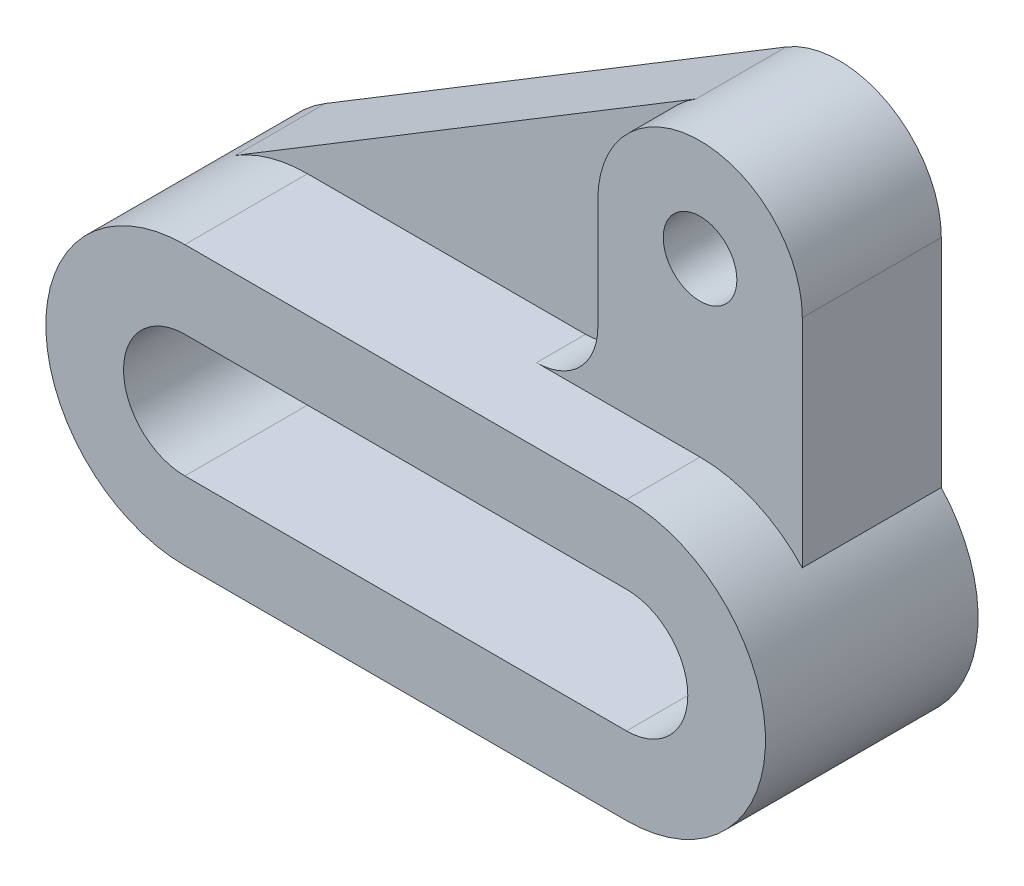
ISO-10303-21;
HEADER;
FILE_DESCRIPTION(('STEP AP214'),'2;1');
FILE_NAME('part.step','',(''),(''),'','','');
FILE_SCHEMA(('AUTOMOTIVE_DESIGN { 1 0 10303 214 1 1 1 1 }'));
ENDSEC;
DATA;
#1=APPLICATION_CONTEXT('core data for automotive mechanical design processes');
#2=APPLICATION_PROTOCOL_DEFINITION('international standard','automotive_design',2000,#1);
#3=PRODUCT_CONTEXT('',#1,'mechanical');
#4=PRODUCT('Part','Part','',(#3));
#5=PRODUCT_RELATED_PRODUCT_CATEGORY('part','',(#4));
#6=PRODUCT_DEFINITION_FORMATION('','',#4);
#7=PRODUCT_DEFINITION_CONTEXT('part definition',#1,'design');
#8=PRODUCT_DEFINITION('design','',#6,#7);
#9=PRODUCT_DEFINITION_SHAPE('','',#8);
#10=(LENGTH_UNIT() NAMED_UNIT(*) SI_UNIT(.MILLI.,.METRE.));
#11=(NAMED_UNIT(*) PLANE_ANGLE_UNIT() SI_UNIT($,.RADIAN.));
#12=(NAMED_UNIT(*) SI_UNIT($,.STERADIAN.) SOLID_ANGLE_UNIT());
#13=UNCERTAINTY_MEASURE_WITH_UNIT(LENGTH_MEASURE(1.E-05),#10,'distance_accuracy_value','');
#14=(GEOMETRIC_REPRESENTATION_CONTEXT(3) GLOBAL_UNCERTAINTY_ASSIGNED_CONTEXT((#13)) GLOBAL_UNIT_ASSIGNED_CONTEXT((#10,
#11,#12)) REPRESENTATION_CONTEXT('',''));
#15=CARTESIAN_POINT('',(0.,0.,0.));
#16=DIRECTION('',(0.,0.,1.));
#17=DIRECTION('',(1.,0.,0.));
#18=AXIS2_PLACEMENT_3D('',#15,#16,#17);
#19=CARTESIAN_POINT('',(54.,0.,-52.));
#20=DIRECTION('',(0.,0.,1.));
#21=DIRECTION('',(1.,0.,0.));
#22=AXIS2_PLACEMENT_3D('',#19,#20,#21);
#23=CYLINDRICAL_SURFACE('',#22,34.);
#24=CARTESIAN_POINT('',(54.,0.,0.));
#25=DIRECTION('',(0.,0.,1.));
#26=DIRECTION('',(1.,0.,0.));
#27=AXIS2_PLACEMENT_3D('',#24,#25,#26);
#28=CIRCLE('',#27,34.);
#29=CARTESIAN_POINT('',(54.,-34.,0.));
#30=VERTEX_POINT('',#29);
#31=CARTESIAN_POINT('',(54.,34.,0.));
#32=VERTEX_POINT('',#31);
#33=EDGE_CURVE('E288',#30,#32,#28,.T.);
#34=ORIENTED_EDGE('',*,*,#33,.F.);
#35=DIRECTION('',(0.,0.,1.));
#36=VECTOR('',#35,1.);
#37=CARTESIAN_POINT('',(54.,-34.,-52.));
#38=LINE('',#37,#36);
#39=CARTESIAN_POINT('',(54.,-34.,-52.));
#40=VERTEX_POINT('',#39);
#41=EDGE_CURVE('E300',#40,#30,#38,.T.);
#42=ORIENTED_EDGE('',*,*,#41,.F.);
#43=CARTESIAN_POINT('',(54.,0.,-52.));
#44=DIRECTION('',(0.,0.,1.));
#45=DIRECTION('',(1.,0.,0.));
#46=AXIS2_PLACEMENT_3D('',#43,#44,#45);
#47=CIRCLE('',#46,34.);
#48=CARTESIAN_POINT('',(79.,23.0434372436058,-52.));
#49=VERTEX_POINT('',#48);
#50=EDGE_CURVE('E277',#40,#49,#47,.T.);
#51=ORIENTED_EDGE('',*,*,#50,.T.);
#52=DIRECTION('',(0.,0.,1.));
#53=VECTOR('',#52,1.);
#54=CARTESIAN_POINT('',(79.,23.0434372436058,-52.));
#55=LINE('',#54,#53);
#56=CARTESIAN_POINT('',(79.,23.0434372436058,-18.));
#57=VERTEX_POINT('',#56);
#58=EDGE_CURVE('E165',#49,#57,#55,.T.);
#59=ORIENTED_EDGE('',*,*,#58,.T.);
#60=CARTESIAN_POINT('',(54.,0.,-18.));
#61=DIRECTION('',(0.,0.,1.));
#62=DIRECTION('',(1.,0.,0.));
#63=AXIS2_PLACEMENT_3D('',#60,#61,#62);
#64=CIRCLE('',#63,34.);
#65=CARTESIAN_POINT('',(54.,34.,-18.));
#66=VERTEX_POINT('',#65);
#67=EDGE_CURVE('E190',#57,#66,#64,.T.);
#68=ORIENTED_EDGE('',*,*,#67,.T.);
#69=DIRECTION('',(0.,0.,1.));
#70=VECTOR('',#69,1.);
#71=CARTESIAN_POINT('',(54.,34.,-52.));
#72=LINE('',#71,#70);
#73=EDGE_CURVE('E297',#66,#32,#72,.T.);
#74=ORIENTED_EDGE('',*,*,#73,.T.);
#75=EDGE_LOOP('',(#34,#42,#51,#59,#68,#74));
#76=FACE_BOUND('',#75,.T.);
#77=ADVANCED_FACE('F45',(#76),#23,.T.);
#78=CARTESIAN_POINT('',(-54.,0.,-52.));
#79=DIRECTION('',(0.,0.,1.));
#80=DIRECTION('',(1.,0.,0.));
#81=AXIS2_PLACEMENT_3D('',#78,#79,#80);
#82=CYLINDRICAL_SURFACE('',#81,34.);
#83=CARTESIAN_POINT('',(-54.,0.,-30.));
#84=DIRECTION('',(0.,0.,1.));
#85=DIRECTION('',(1.,0.,0.));
#86=AXIS2_PLACEMENT_3D('',#83,#84,#85);
#87=CIRCLE('',#86,34.);
#88=CARTESIAN_POINT('',(-71.6263298981798,29.0742582763608,-30.));
#89=VERTEX_POINT('',#88);
#90=CARTESIAN_POINT('',(-54.,34.,-30.));
#91=VERTEX_POINT('',#90);
#92=EDGE_CURVE('E61',#89,#91,#87,.F.);
#93=ORIENTED_EDGE('',*,*,#92,.F.);
#94=DIRECTION('',(0.,0.,1.));
#95=VECTOR('',#94,1.);
#96=CARTESIAN_POINT('',(-71.6263298981798,29.0742582763608,-52.));
#97=LINE('',#96,#95);
#98=CARTESIAN_POINT('',(-71.6263298981798,29.0742582763608,-52.));
#99=VERTEX_POINT('',#98);
#100=EDGE_CURVE('E194',#99,#89,#97,.T.);
#101=ORIENTED_EDGE('',*,*,#100,.F.);
#102=CARTESIAN_POINT('',(-54.,0.,-52.));
#103=DIRECTION('',(0.,0.,1.));
#104=DIRECTION('',(1.,0.,0.));
#105=AXIS2_PLACEMENT_3D('',#102,#103,#104);
#106=CIRCLE('',#105,34.);
#107=CARTESIAN_POINT('',(-54.,-34.,-52.));
#108=VERTEX_POINT('',#107);
#109=EDGE_CURVE('E269',#99,#108,#106,.T.);
#110=ORIENTED_EDGE('',*,*,#109,.T.);
#111=DIRECTION('',(0.,0.,1.));
#112=VECTOR('',#111,1.);
#113=CARTESIAN_POINT('',(-54.,-34.,-52.));
#114=LINE('',#113,#112);
#115=CARTESIAN_POINT('',(-54.,-34.,0.));
#116=VERTEX_POINT('',#115);
#117=EDGE_CURVE('E280',#108,#116,#114,.T.);
#118=ORIENTED_EDGE('',*,*,#117,.T.);
#119=CARTESIAN_POINT('',(-54.,0.,0.));
#120=DIRECTION('',(0.,0.,1.));
#121=DIRECTION('',(1.,0.,0.));
#122=AXIS2_PLACEMENT_3D('',#119,#120,#121);
#123=CIRCLE('',#122,34.);
#124=CARTESIAN_POINT('',(-54.,34.,0.));
#125=VERTEX_POINT('',#124);
#126=EDGE_CURVE('E260',#125,#116,#123,.T.);
#127=ORIENTED_EDGE('',*,*,#126,.F.);
#128=DIRECTION('',(0.,0.,1.));
#129=VECTOR('',#128,1.);
#130=CARTESIAN_POINT('',(-54.,34.,-52.));
#131=LINE('',#130,#129);
#132=EDGE_CURVE('E54',#91,#125,#131,.T.);
#133=ORIENTED_EDGE('',*,*,#132,.F.);
#134=EDGE_LOOP('',(#93,#101,#110,#118,#127,#133));
#135=FACE_BOUND('',#134,.T.);
#136=ADVANCED_FACE('F47',(#135),#82,.T.);
#137=CARTESIAN_POINT('',(-54.,34.,-52.));
#138=DIRECTION('',(0.,1.,0.));
#139=DIRECTION('',(-1.,0.,0.));
#140=AXIS2_PLACEMENT_3D('',#137,#138,#139);
#141=PLANE('',#140);
#142=DIRECTION('',(1.,0.,0.));
#143=VECTOR('',#142,1.);
#144=CARTESIAN_POINT('',(-54.,34.,-30.));
#145=LINE('',#144,#143);
#146=CARTESIAN_POINT('',(14.,34.,-30.));
#147=VERTEX_POINT('',#146);
#148=EDGE_CURVE('E69',#91,#147,#145,.T.);
#149=ORIENTED_EDGE('',*,*,#148,.F.);
#150=ORIENTED_EDGE('',*,*,#132,.T.);
#151=DIRECTION('',(-1.,0.,0.));
#152=VECTOR('',#151,1.);
#153=CARTESIAN_POINT('',(-54.,34.,0.));
#154=LINE('',#153,#152);
#155=EDGE_CURVE('E273',#32,#125,#154,.T.);
#156=ORIENTED_EDGE('',*,*,#155,.F.);
#157=ORIENTED_EDGE('',*,*,#73,.F.);
#158=DIRECTION('',(1.,0.,0.));
#159=VECTOR('',#158,1.);
#160=CARTESIAN_POINT('',(0.,34.,-18.));
#161=LINE('',#160,#159);
#162=CARTESIAN_POINT('',(14.,34.,-18.));
#163=VERTEX_POINT('',#162);
#164=EDGE_CURVE('E207',#163,#66,#161,.T.);
#165=ORIENTED_EDGE('',*,*,#164,.F.);
#166=DIRECTION('',(0.,0.,1.));
#167=VECTOR('',#166,1.);
#168=CARTESIAN_POINT('',(14.,34.,-52.));
#169=LINE('',#168,#167);
#170=EDGE_CURVE('E214',#147,#163,#169,.T.);
#171=ORIENTED_EDGE('',*,*,#170,.F.);
#172=EDGE_LOOP('',(#149,#150,#156,#157,#165,#171));
#173=FACE_BOUND('',#172,.T.);
#174=ADVANCED_FACE('F314',(#173),#141,.T.);
#175=CARTESIAN_POINT('',(-54.,-34.,-52.));
#176=DIRECTION('',(0.,-1.,0.));
#177=DIRECTION('',(1.,0.,0.));
#178=AXIS2_PLACEMENT_3D('',#175,#176,#177);
#179=PLANE('',#178);
#180=DIRECTION('',(1.,0.,0.));
#181=VECTOR('',#180,1.);
#182=CARTESIAN_POINT('',(-54.,-34.,0.));
#183=LINE('',#182,#181);
#184=EDGE_CURVE('E284',#116,#30,#183,.T.);
#185=ORIENTED_EDGE('',*,*,#184,.F.);
#186=ORIENTED_EDGE('',*,*,#117,.F.);
#187=DIRECTION('',(1.,0.,0.));
#188=VECTOR('',#187,1.);
#189=CARTESIAN_POINT('',(-54.,-34.,-52.));
#190=LINE('',#189,#188);
#191=EDGE_CURVE('E272',#108,#40,#190,.T.);
#192=ORIENTED_EDGE('',*,*,#191,.T.);
#193=ORIENTED_EDGE('',*,*,#41,.T.);
#194=EDGE_LOOP('',(#185,#186,#192,#193));
#195=FACE_BOUND('',#194,.T.);
#196=ADVANCED_FACE('F308',(#195),#179,.T.);
#197=CARTESIAN_POINT('',(-54.,0.,-52.));
#198=DIRECTION('',(0.,0.,1.));
#199=DIRECTION('',(1.,0.,0.));
#200=AXIS2_PLACEMENT_3D('',#197,#198,#199);
#201=PLANE('',#200);
#202=ORIENTED_EDGE('',*,*,#109,.F.);
#203=DIRECTION('',(0.855125243422376,0.518421467593524,0.));
#204=VECTOR('',#203,1.);
#205=CARTESIAN_POINT('',(-71.6263298981798,29.0742582763608,-52.));
#206=LINE('',#205,#204);
#207=CARTESIAN_POINT('',(41.0394633101619,97.3781310855594,-52.));
#208=VERTEX_POINT('',#207);
#209=EDGE_CURVE('E181',#99,#208,#206,.T.);
#210=ORIENTED_EDGE('',*,*,#209,.T.);
#211=CARTESIAN_POINT('',(54.,76.,-52.));
#212=DIRECTION('',(0.,0.,1.));
#213=DIRECTION('',(1.,0.,0.));
#214=AXIS2_PLACEMENT_3D('',#211,#212,#213);
#215=CIRCLE('',#214,25.);
#216=CARTESIAN_POINT('',(79.,76.,-52.));
#217=VERTEX_POINT('',#216);
#218=EDGE_CURVE('E156',#217,#208,#215,.T.);
#219=ORIENTED_EDGE('',*,*,#218,.F.);
#220=DIRECTION('',(0.,-1.,0.));
#221=VECTOR('',#220,1.);
#222=CARTESIAN_POINT('',(79.,0.,-52.));
#223=LINE('',#222,#221);
#224=EDGE_CURVE('E169',#217,#49,#223,.T.);
#225=ORIENTED_EDGE('',*,*,#224,.T.);
#226=ORIENTED_EDGE('',*,*,#50,.F.);
#227=ORIENTED_EDGE('',*,*,#191,.F.);
#228=EDGE_LOOP('',(#202,#210,#219,#225,#226,#227));
#229=FACE_BOUND('',#228,.T.);
#230=DIRECTION('',(-1.,0.,0.));
#231=VECTOR('',#230,1.);
#232=CARTESIAN_POINT('',(-54.,15.,-52.));
#233=LINE('',#232,#231);
#234=CARTESIAN_POINT('',(54.,15.,-52.));
#235=VERTEX_POINT('',#234);
#236=CARTESIAN_POINT('',(-54.,15.,-52.));
#237=VERTEX_POINT('',#236);
#238=EDGE_CURVE('E238',#235,#237,#233,.T.);
#239=ORIENTED_EDGE('',*,*,#238,.T.);
#240=CARTESIAN_POINT('',(-54.,0.,-52.));
#241=DIRECTION('',(0.,0.,1.));
#242=DIRECTION('',(1.,0.,0.));
#243=AXIS2_PLACEMENT_3D('',#240,#241,#242);
#244=CIRCLE('',#243,15.);
#245=CARTESIAN_POINT('',(-54.,-15.,-52.));
#246=VERTEX_POINT('',#245);
#247=EDGE_CURVE('E225',#237,#246,#244,.T.);
#248=ORIENTED_EDGE('',*,*,#247,.T.);
#249=DIRECTION('',(1.,0.,0.));
#250=VECTOR('',#249,1.);
#251=CARTESIAN_POINT('',(-54.,-15.,-52.));
#252=LINE('',#251,#250);
#253=CARTESIAN_POINT('',(54.,-15.,-52.));
#254=VERTEX_POINT('',#253);
#255=EDGE_CURVE('E229',#246,#254,#252,.T.);
#256=ORIENTED_EDGE('',*,*,#255,.T.);
#257=CARTESIAN_POINT('',(54.,0.,-52.));
#258=DIRECTION('',(0.,0.,1.));
#259=DIRECTION('',(1.,0.,0.));
#260=AXIS2_PLACEMENT_3D('',#257,#258,#259);
#261=CIRCLE('',#260,15.);
#262=EDGE_CURVE('E234',#254,#235,#261,.T.);
#263=ORIENTED_EDGE('',*,*,#262,.T.);
#264=EDGE_LOOP('',(#239,#248,#256,#263));
#265=FACE_BOUND('',#264,.T.);
#266=CARTESIAN_POINT('',(54.,76.,-52.));
#267=DIRECTION('',(0.,0.,1.));
#268=DIRECTION('',(1.,0.,0.));
#269=AXIS2_PLACEMENT_3D('',#266,#267,#268);
#270=CIRCLE('',#269,9.00000000000001);
#271=CARTESIAN_POINT('',(63.,76.,-52.));
#272=VERTEX_POINT('',#271);
#273=EDGE_CURVE('E183',#272,#272,#270,.T.);
#274=ORIENTED_EDGE('',*,*,#273,.T.);
#275=EDGE_LOOP('',(#274));
#276=FACE_BOUND('',#275,.T.);
#277=ADVANCED_FACE('F178',(#229,#265,#276),#201,.F.);
#278=CARTESIAN_POINT('',(-54.,0.,0.));
#279=DIRECTION('',(0.,0.,1.));
#280=DIRECTION('',(1.,0.,0.));
#281=AXIS2_PLACEMENT_3D('',#278,#279,#280);
#282=PLANE('',#281);
#283=CARTESIAN_POINT('',(-54.,0.,0.));
#284=DIRECTION('',(0.,0.,1.));
#285=DIRECTION('',(1.,0.,0.));
#286=AXIS2_PLACEMENT_3D('',#283,#284,#285);
#287=CIRCLE('',#286,15.);
#288=CARTESIAN_POINT('',(-54.,15.,0.));
#289=VERTEX_POINT('',#288);
#290=CARTESIAN_POINT('',(-54.,-15.,0.));
#291=VERTEX_POINT('',#290);
#292=EDGE_CURVE('E217',#289,#291,#287,.T.);
#293=ORIENTED_EDGE('',*,*,#292,.F.);
#294=DIRECTION('',(-1.,0.,0.));
#295=VECTOR('',#294,1.);
#296=CARTESIAN_POINT('',(-54.,15.,0.));
#297=LINE('',#296,#295);
#298=CARTESIAN_POINT('',(54.,15.,0.));
#299=VERTEX_POINT('',#298);
#300=EDGE_CURVE('E230',#299,#289,#297,.T.);
#301=ORIENTED_EDGE('',*,*,#300,.F.);
#302=CARTESIAN_POINT('',(54.,0.,0.));
#303=DIRECTION('',(0.,0.,1.));
#304=DIRECTION('',(1.,0.,0.));
#305=AXIS2_PLACEMENT_3D('',#302,#303,#304);
#306=CIRCLE('',#305,15.);
#307=CARTESIAN_POINT('',(54.,-15.,0.));
#308=VERTEX_POINT('',#307);
#309=EDGE_CURVE('E250',#308,#299,#306,.T.);
#310=ORIENTED_EDGE('',*,*,#309,.F.);
#311=DIRECTION('',(1.,0.,0.));
#312=VECTOR('',#311,1.);
#313=CARTESIAN_POINT('',(-54.,-15.,0.));
#314=LINE('',#313,#312);
#315=EDGE_CURVE('E246',#291,#308,#314,.T.);
#316=ORIENTED_EDGE('',*,*,#315,.F.);
#317=EDGE_LOOP('',(#293,#301,#310,#316));
#318=FACE_BOUND('',#317,.T.);
#319=ORIENTED_EDGE('',*,*,#126,.T.);
#320=ORIENTED_EDGE('',*,*,#184,.T.);
#321=ORIENTED_EDGE('',*,*,#33,.T.);
#322=ORIENTED_EDGE('',*,*,#155,.T.);
#323=EDGE_LOOP('',(#319,#320,#321,#322));
#324=FACE_BOUND('',#323,.T.);
#325=ADVANCED_FACE('F311',(#318,#324),#282,.T.);
#326=CARTESIAN_POINT('',(-54.,0.,-52.));
#327=DIRECTION('',(0.,0.,1.));
#328=DIRECTION('',(1.,0.,0.));
#329=AXIS2_PLACEMENT_3D('',#326,#327,#328);
#330=CYLINDRICAL_SURFACE('',#329,15.);
#331=ORIENTED_EDGE('',*,*,#292,.T.);
#332=DIRECTION('',(0.,0.,1.));
#333=VECTOR('',#332,1.);
#334=CARTESIAN_POINT('',(-54.,-15.,-52.));
#335=LINE('',#334,#333);
#336=EDGE_CURVE('E242',#246,#291,#335,.T.);
#337=ORIENTED_EDGE('',*,*,#336,.F.);
#338=ORIENTED_EDGE('',*,*,#247,.F.);
#339=DIRECTION('',(0.,0.,1.));
#340=VECTOR('',#339,1.);
#341=CARTESIAN_POINT('',(-54.,15.,-52.));
#342=LINE('',#341,#340);
#343=EDGE_CURVE('E257',#237,#289,#342,.T.);
#344=ORIENTED_EDGE('',*,*,#343,.T.);
#345=EDGE_LOOP('',(#331,#337,#338,#344));
#346=FACE_BOUND('',#345,.T.);
#347=ADVANCED_FACE('F414',(#346),#330,.F.);
#348=CARTESIAN_POINT('',(-54.,15.,-52.));
#349=DIRECTION('',(0.,1.,0.));
#350=DIRECTION('',(-1.,0.,0.));
#351=AXIS2_PLACEMENT_3D('',#348,#349,#350);
#352=PLANE('',#351);
#353=ORIENTED_EDGE('',*,*,#300,.T.);
#354=ORIENTED_EDGE('',*,*,#343,.F.);
#355=ORIENTED_EDGE('',*,*,#238,.F.);
#356=DIRECTION('',(0.,0.,1.));
#357=VECTOR('',#356,1.);
#358=CARTESIAN_POINT('',(54.,15.,-52.));
#359=LINE('',#358,#357);
#360=EDGE_CURVE('E261',#235,#299,#359,.T.);
#361=ORIENTED_EDGE('',*,*,#360,.T.);
#362=EDGE_LOOP('',(#353,#354,#355,#361));
#363=FACE_BOUND('',#362,.T.);
#364=ADVANCED_FACE('F428',(#363),#352,.F.);
#365=CARTESIAN_POINT('',(54.,0.,-52.));
#366=DIRECTION('',(0.,0.,1.));
#367=DIRECTION('',(1.,0.,0.));
#368=AXIS2_PLACEMENT_3D('',#365,#366,#367);
#369=CYLINDRICAL_SURFACE('',#368,15.);
#370=ORIENTED_EDGE('',*,*,#309,.T.);
#371=ORIENTED_EDGE('',*,*,#360,.F.);
#372=ORIENTED_EDGE('',*,*,#262,.F.);
#373=DIRECTION('',(0.,0.,1.));
#374=VECTOR('',#373,1.);
#375=CARTESIAN_POINT('',(54.,-15.,-52.));
#376=LINE('',#375,#374);
#377=EDGE_CURVE('E264',#254,#308,#376,.T.);
#378=ORIENTED_EDGE('',*,*,#377,.T.);
#379=EDGE_LOOP('',(#370,#371,#372,#378));
#380=FACE_BOUND('',#379,.T.);
#381=ADVANCED_FACE('F435',(#380),#369,.F.);
#382=CARTESIAN_POINT('',(-54.,-15.,-52.));
#383=DIRECTION('',(0.,-1.,0.));
#384=DIRECTION('',(1.,0.,0.));
#385=AXIS2_PLACEMENT_3D('',#382,#383,#384);
#386=PLANE('',#385);
#387=ORIENTED_EDGE('',*,*,#315,.T.);
#388=ORIENTED_EDGE('',*,*,#377,.F.);
#389=ORIENTED_EDGE('',*,*,#255,.F.);
#390=ORIENTED_EDGE('',*,*,#336,.T.);
#391=EDGE_LOOP('',(#387,#388,#389,#390));
#392=FACE_BOUND('',#391,.T.);
#393=ADVANCED_FACE('F364',(#392),#386,.F.);
#394=CARTESIAN_POINT('',(14.,49.,-52.));
#395=DIRECTION('',(0.,0.,1.));
#396=DIRECTION('',(1.,0.,0.));
#397=AXIS2_PLACEMENT_3D('',#394,#395,#396);
#398=CYLINDRICAL_SURFACE('',#397,15.);
#399=DIRECTION('',(0.,0.,1.));
#400=VECTOR('',#399,1.);
#401=CARTESIAN_POINT('',(29.,49.0000000000001,-52.));
#402=LINE('',#401,#400);
#403=CARTESIAN_POINT('',(29.,49.0000000000001,-30.));
#404=VERTEX_POINT('',#403);
#405=CARTESIAN_POINT('',(29.,49.0000000000001,-18.));
#406=VERTEX_POINT('',#405);
#407=EDGE_CURVE('E218',#404,#406,#402,.T.);
#408=ORIENTED_EDGE('',*,*,#407,.F.);
#409=CARTESIAN_POINT('',(14.,49.,-30.));
#410=DIRECTION('',(0.,0.,1.));
#411=DIRECTION('',(1.,0.,0.));
#412=AXIS2_PLACEMENT_3D('',#409,#410,#411);
#413=CIRCLE('',#412,15.);
#414=EDGE_CURVE('E327',#404,#147,#413,.F.);
#415=ORIENTED_EDGE('',*,*,#414,.T.);
#416=ORIENTED_EDGE('',*,*,#170,.T.);
#417=CARTESIAN_POINT('',(14.,49.,-18.));
#418=DIRECTION('',(0.,0.,1.));
#419=DIRECTION('',(1.,0.,0.));
#420=AXIS2_PLACEMENT_3D('',#417,#418,#419);
#421=CIRCLE('',#420,15.);
#422=EDGE_CURVE('E203',#163,#406,#421,.T.);
#423=ORIENTED_EDGE('',*,*,#422,.T.);
#424=EDGE_LOOP('',(#408,#415,#416,#423));
#425=FACE_BOUND('',#424,.T.);
#426=ADVANCED_FACE('F352',(#425),#398,.F.);
#427=CARTESIAN_POINT('',(29.,0.,-52.));
#428=DIRECTION('',(-1.,0.,0.));
#429=DIRECTION('',(0.,0.,1.));
#430=AXIS2_PLACEMENT_3D('',#427,#428,#429);
#431=PLANE('',#430);
#432=DIRECTION('',(0.,1.,0.));
#433=VECTOR('',#432,1.);
#434=CARTESIAN_POINT('',(29.,0.,-30.));
#435=LINE('',#434,#433);
#436=CARTESIAN_POINT('',(29.,76.,-30.));
#437=VERTEX_POINT('',#436);
#438=EDGE_CURVE('E332',#404,#437,#435,.T.);
#439=ORIENTED_EDGE('',*,*,#438,.F.);
#440=ORIENTED_EDGE('',*,*,#407,.T.);
#441=DIRECTION('',(0.,-1.,0.));
#442=VECTOR('',#441,1.);
#443=CARTESIAN_POINT('',(29.,0.,-18.));
#444=LINE('',#443,#442);
#445=CARTESIAN_POINT('',(29.,76.,-18.));
#446=VERTEX_POINT('',#445);
#447=EDGE_CURVE('E199',#446,#406,#444,.T.);
#448=ORIENTED_EDGE('',*,*,#447,.F.);
#449=DIRECTION('',(0.,0.,1.));
#450=VECTOR('',#449,1.);
#451=CARTESIAN_POINT('',(29.,76.,-52.));
#452=LINE('',#451,#450);
#453=EDGE_CURVE('E164',#437,#446,#452,.T.);
#454=ORIENTED_EDGE('',*,*,#453,.F.);
#455=EDGE_LOOP('',(#439,#440,#448,#454));
#456=FACE_BOUND('',#455,.T.);
#457=ADVANCED_FACE('F355',(#456),#431,.T.);
#458=CARTESIAN_POINT('',(54.,76.,-52.));
#459=DIRECTION('',(0.,0.,1.));
#460=DIRECTION('',(1.,0.,0.));
#461=AXIS2_PLACEMENT_3D('',#458,#459,#460);
#462=CYLINDRICAL_SURFACE('',#461,25.);
#463=CARTESIAN_POINT('',(54.,76.,-18.));
#464=DIRECTION('',(0.,0.,1.));
#465=DIRECTION('',(1.,0.,0.));
#466=AXIS2_PLACEMENT_3D('',#463,#464,#465);
#467=CIRCLE('',#466,25.);
#468=CARTESIAN_POINT('',(79.,76.,-18.));
#469=VERTEX_POINT('',#468);
#470=EDGE_CURVE('E159',#469,#446,#467,.T.);
#471=ORIENTED_EDGE('',*,*,#470,.F.);
#472=DIRECTION('',(0.,0.,1.));
#473=VECTOR('',#472,1.);
#474=CARTESIAN_POINT('',(79.,76.,-52.));
#475=LINE('',#474,#473);
#476=EDGE_CURVE('E152',#217,#469,#475,.T.);
#477=ORIENTED_EDGE('',*,*,#476,.F.);
#478=ORIENTED_EDGE('',*,*,#218,.T.);
#479=DIRECTION('',(0.,0.,1.));
#480=VECTOR('',#479,1.);
#481=CARTESIAN_POINT('',(41.0394633101619,97.3781310855594,-52.));
#482=LINE('',#481,#480);
#483=CARTESIAN_POINT('',(41.0394633101619,97.3781310855594,-30.));
#484=VERTEX_POINT('',#483);
#485=EDGE_CURVE('E11',#208,#484,#482,.T.);
#486=ORIENTED_EDGE('',*,*,#485,.T.);
#487=CARTESIAN_POINT('',(54.,76.,-30.));
#488=DIRECTION('',(0.,0.,1.));
#489=DIRECTION('',(1.,0.,0.));
#490=AXIS2_PLACEMENT_3D('',#487,#488,#489);
#491=CIRCLE('',#490,25.);
#492=EDGE_CURVE('E336',#437,#484,#491,.F.);
#493=ORIENTED_EDGE('',*,*,#492,.F.);
#494=ORIENTED_EDGE('',*,*,#453,.T.);
#495=EDGE_LOOP('',(#471,#477,#478,#486,#493,#494));
#496=FACE_BOUND('',#495,.T.);
#497=ADVANCED_FACE('F154',(#496),#462,.T.);
#498=CARTESIAN_POINT('',(79.,0.,-52.));
#499=DIRECTION('',(-1.,0.,0.));
#500=DIRECTION('',(0.,0.,1.));
#501=AXIS2_PLACEMENT_3D('',#498,#499,#500);
#502=PLANE('',#501);
#503=DIRECTION('',(0.,-1.,0.));
#504=VECTOR('',#503,1.);
#505=CARTESIAN_POINT('',(79.,0.,-18.));
#506=LINE('',#505,#504);
#507=EDGE_CURVE('E193',#469,#57,#506,.T.);
#508=ORIENTED_EDGE('',*,*,#507,.T.);
#509=ORIENTED_EDGE('',*,*,#58,.F.);
#510=ORIENTED_EDGE('',*,*,#224,.F.);
#511=ORIENTED_EDGE('',*,*,#476,.T.);
#512=EDGE_LOOP('',(#508,#509,#510,#511));
#513=FACE_BOUND('',#512,.T.);
#514=ADVANCED_FACE('F170',(#513),#502,.F.);
#515=CARTESIAN_POINT('',(54.,76.,-52.));
#516=DIRECTION('',(0.,0.,1.));
#517=DIRECTION('',(1.,0.,0.));
#518=AXIS2_PLACEMENT_3D('',#515,#516,#517);
#519=CYLINDRICAL_SURFACE('',#518,9.00000000000001);
#520=CARTESIAN_POINT('',(54.,76.,-18.));
#521=DIRECTION('',(0.,0.,1.));
#522=DIRECTION('',(1.,0.,0.));
#523=AXIS2_PLACEMENT_3D('',#520,#521,#522);
#524=CIRCLE('',#523,9.00000000000001);
#525=CARTESIAN_POINT('',(63.,76.,-18.));
#526=VERTEX_POINT('',#525);
#527=EDGE_CURVE('E174',#526,#526,#524,.T.);
#528=ORIENTED_EDGE('',*,*,#527,.T.);
#529=EDGE_LOOP('',(#528));
#530=FACE_BOUND('',#529,.T.);
#531=ORIENTED_EDGE('',*,*,#273,.F.);
#532=EDGE_LOOP('',(#531));
#533=FACE_BOUND('',#532,.T.);
#534=ADVANCED_FACE('F401',(#530,#533),#519,.F.);
#535=CARTESIAN_POINT('',(0.,0.,-18.));
#536=DIRECTION('',(0.,0.,1.));
#537=DIRECTION('',(1.,0.,0.));
#538=AXIS2_PLACEMENT_3D('',#535,#536,#537);
#539=PLANE('',#538);
#540=ORIENTED_EDGE('',*,*,#67,.F.);
#541=ORIENTED_EDGE('',*,*,#507,.F.);
#542=ORIENTED_EDGE('',*,*,#470,.T.);
#543=ORIENTED_EDGE('',*,*,#447,.T.);
#544=ORIENTED_EDGE('',*,*,#422,.F.);
#545=ORIENTED_EDGE('',*,*,#164,.T.);
#546=EDGE_LOOP('',(#540,#541,#542,#543,#544,#545));
#547=FACE_BOUND('',#546,.T.);
#548=ORIENTED_EDGE('',*,*,#527,.F.);
#549=EDGE_LOOP('',(#548));
#550=FACE_BOUND('',#549,.T.);
#551=ADVANCED_FACE('F347',(#547,#550),#539,.T.);
#552=CARTESIAN_POINT('',(-71.6263298981798,29.0742582763608,-30.));
#553=DIRECTION('',(0.518421467593524,-0.855125243422376,0.));
#554=DIRECTION('',(0.855125243422376,0.518421467593524,0.));
#555=AXIS2_PLACEMENT_3D('',#552,#553,#554);
#556=PLANE('',#555);
#557=ORIENTED_EDGE('',*,*,#209,.F.);
#558=ORIENTED_EDGE('',*,*,#100,.T.);
#559=DIRECTION('',(0.855125243422376,0.518421467593524,0.));
#560=VECTOR('',#559,1.);
#561=CARTESIAN_POINT('',(-71.6263298981798,29.0742582763608,-30.));
#562=LINE('',#561,#560);
#563=EDGE_CURVE('E322',#89,#484,#562,.T.);
#564=ORIENTED_EDGE('',*,*,#563,.T.);
#565=ORIENTED_EDGE('',*,*,#485,.F.);
#566=EDGE_LOOP('',(#557,#558,#564,#565));
#567=FACE_BOUND('',#566,.T.);
#568=ADVANCED_FACE('F343',(#567),#556,.F.);
#569=CARTESIAN_POINT('',(0.,33.5,-30.));
#570=DIRECTION('',(0.,0.,1.));
#571=DIRECTION('',(1.,0.,0.));
#572=AXIS2_PLACEMENT_3D('',#569,#570,#571);
#573=PLANE('',#572);
#574=ORIENTED_EDGE('',*,*,#563,.F.);
#575=ORIENTED_EDGE('',*,*,#92,.T.);
#576=ORIENTED_EDGE('',*,*,#148,.T.);
#577=ORIENTED_EDGE('',*,*,#414,.F.);
#578=ORIENTED_EDGE('',*,*,#438,.T.);
#579=ORIENTED_EDGE('',*,*,#492,.T.);
#580=EDGE_LOOP('',(#574,#575,#576,#577,#578,#579));
#581=FACE_BOUND('',#580,.T.);
#582=ADVANCED_FACE('F318',(#581),#573,.T.);
#583=CLOSED_SHELL('',(#77,#136,#174,#196,#277,#325,#347,#364,#381,#393,#426,#457,#497,#514,#534,
#551,#568,#582));
#584=MANIFOLD_SOLID_BREP('B2',#583);
#585=ADVANCED_BREP_SHAPE_REPRESENTATION('',(#18,#584),#14);
#586=SHAPE_DEFINITION_REPRESENTATION(#9,#585);
ENDSEC;
END-ISO-10303-21;
